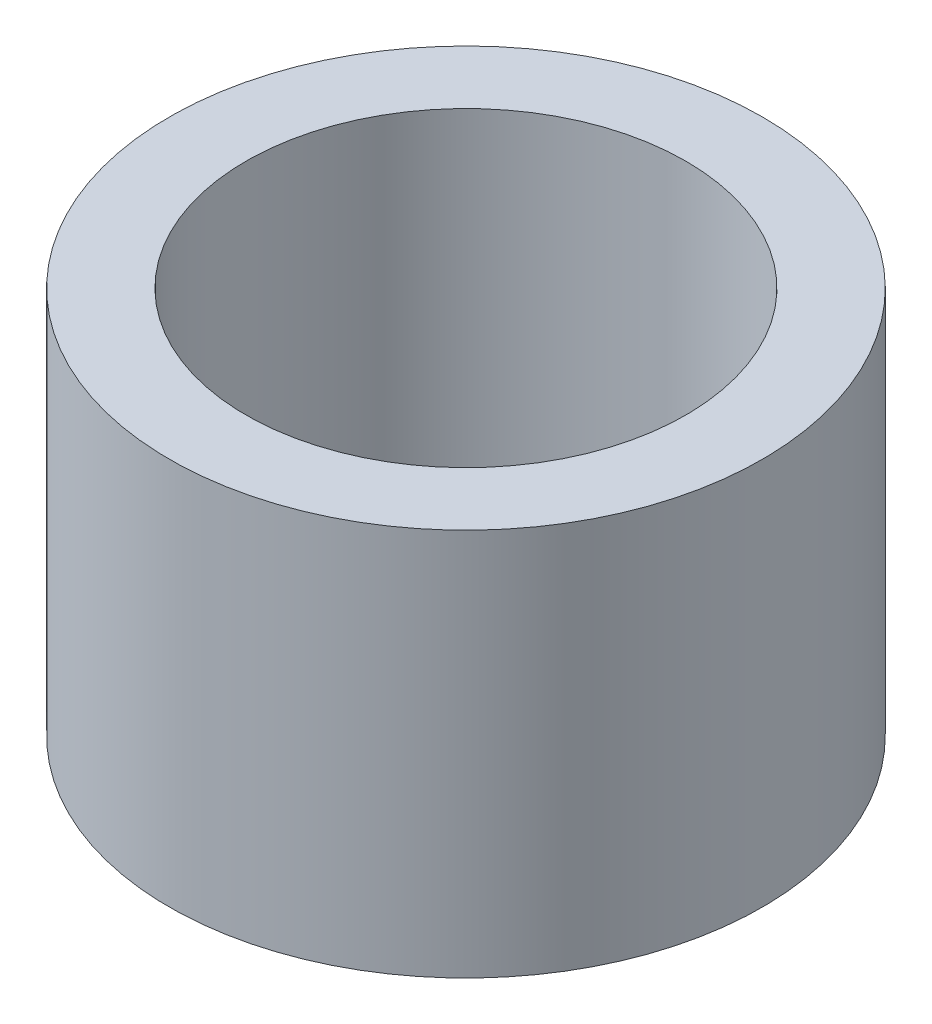
ISO-10303-21;
HEADER;
FILE_DESCRIPTION(('STEP AP214'),'2;1');
FILE_NAME('part.step','',(''),(''),'','','');
FILE_SCHEMA(('AUTOMOTIVE_DESIGN { 1 0 10303 214 1 1 1 1 }'));
ENDSEC;
DATA;
#1=APPLICATION_CONTEXT('core data for automotive mechanical design processes');
#2=APPLICATION_PROTOCOL_DEFINITION('international standard','automotive_design',2000,#1);
#3=PRODUCT_CONTEXT('',#1,'mechanical');
#4=PRODUCT('Part','Part','',(#3));
#5=PRODUCT_RELATED_PRODUCT_CATEGORY('part','',(#4));
#6=PRODUCT_DEFINITION_FORMATION('','',#4);
#7=PRODUCT_DEFINITION_CONTEXT('part definition',#1,'design');
#8=PRODUCT_DEFINITION('design','',#6,#7);
#9=PRODUCT_DEFINITION_SHAPE('','',#8);
#10=(LENGTH_UNIT() NAMED_UNIT(*) SI_UNIT(.MILLI.,.METRE.));
#11=(NAMED_UNIT(*) PLANE_ANGLE_UNIT() SI_UNIT($,.RADIAN.));
#12=(NAMED_UNIT(*) SI_UNIT($,.STERADIAN.) SOLID_ANGLE_UNIT());
#13=UNCERTAINTY_MEASURE_WITH_UNIT(LENGTH_MEASURE(1.E-05),#10,'distance_accuracy_value','');
#14=(GEOMETRIC_REPRESENTATION_CONTEXT(3) GLOBAL_UNCERTAINTY_ASSIGNED_CONTEXT((#13)) GLOBAL_UNIT_ASSIGNED_CONTEXT((#10,
#11,#12)) REPRESENTATION_CONTEXT('',''));
#15=CARTESIAN_POINT('',(0.,0.,0.));
#16=DIRECTION('',(0.,0.,1.));
#17=DIRECTION('',(1.,0.,0.));
#18=AXIS2_PLACEMENT_3D('',#15,#16,#17);
#19=CARTESIAN_POINT('',(0.,13.0809065304929,0.));
#20=DIRECTION('',(0.,-1.,0.));
#21=DIRECTION('',(0.,0.,-1.));
#22=AXIS2_PLACEMENT_3D('',#19,#20,#21);
#23=CYLINDRICAL_SURFACE('',#22,10.);
#24=CARTESIAN_POINT('',(0.,13.0809065304929,0.));
#25=DIRECTION('',(0.,1.,0.));
#26=DIRECTION('',(0.,0.,1.));
#27=AXIS2_PLACEMENT_3D('',#24,#25,#26);
#28=CIRCLE('',#27,10.);
#29=CARTESIAN_POINT('',(0.,13.0809065304929,-10.));
#30=VERTEX_POINT('',#29);
#31=EDGE_CURVE('E10',#30,#30,#28,.T.);
#32=CARTESIAN_POINT('',(0.,0.,0.));
#33=DIRECTION('',(0.,1.,0.));
#34=DIRECTION('',(0.,0.,1.));
#35=AXIS2_PLACEMENT_3D('',#32,#33,#34);
#36=CIRCLE('',#35,10.);
#37=CARTESIAN_POINT('',(0.,0.,-10.));
#38=VERTEX_POINT('',#37);
#39=EDGE_CURVE('E37',#38,#38,#36,.T.);
#40=CARTESIAN_POINT('',(0.,13.0809065304929,-10.));
#41=CARTESIAN_POINT('',(0.,12.944647087467,-10.));
#42=CARTESIAN_POINT('',(0.,12.808387644441,-10.));
#43=CARTESIAN_POINT('',(0.,12.5358687583891,-10.));
#44=CARTESIAN_POINT('',(0.,12.3996093153631,-10.));
#45=CARTESIAN_POINT('',(0.,12.1270904293112,-10.));
#46=CARTESIAN_POINT('',(0.,11.9908309862852,-10.));
#47=CARTESIAN_POINT('',(0.,11.7183121002333,-10.));
#48=CARTESIAN_POINT('',(0.,11.5820526572073,-10.));
#49=CARTESIAN_POINT('',(0.,11.3095337711554,-10.));
#50=CARTESIAN_POINT('',(0.,11.1732743281294,-10.));
#51=CARTESIAN_POINT('',(0.,10.9007554420775,-10.));
#52=CARTESIAN_POINT('',(0.,10.7644959990515,-10.));
#53=CARTESIAN_POINT('',(0.,10.4919771129996,-10.));
#54=CARTESIAN_POINT('',(0.,10.3557176699736,-10.));
#55=CARTESIAN_POINT('',(0.,10.0831987839216,-10.));
#56=CARTESIAN_POINT('',(0.,9.94693934089568,-10.));
#57=CARTESIAN_POINT('',(0.,9.67442045484374,-10.));
#58=CARTESIAN_POINT('',(0.,9.53816101181777,-10.));
#59=CARTESIAN_POINT('',(0.,9.26564212576584,-10.));
#60=CARTESIAN_POINT('',(0.,9.12938268273987,-10.));
#61=CARTESIAN_POINT('',(0.,8.85686379668793,-10.));
#62=CARTESIAN_POINT('',(0.,8.72060435366196,-10.));
#63=CARTESIAN_POINT('',(0.,8.44808546761003,-10.));
#64=CARTESIAN_POINT('',(0.,8.31182602458406,-10.));
#65=CARTESIAN_POINT('',(0.,8.03930713853212,-10.));
#66=CARTESIAN_POINT('',(0.,7.90304769550616,-10.));
#67=CARTESIAN_POINT('',(0.,7.63052880945422,-10.));
#68=CARTESIAN_POINT('',(0.,7.49426936642825,-10.));
#69=CARTESIAN_POINT('',(0.,7.22175048037631,-10.));
#70=CARTESIAN_POINT('',(0.,7.08549103735035,-10.));
#71=CARTESIAN_POINT('',(0.,6.81297215129841,-10.));
#72=CARTESIAN_POINT('',(0.,6.67671270827244,-10.));
#73=CARTESIAN_POINT('',(0.,6.40419382222051,-10.));
#74=CARTESIAN_POINT('',(0.,6.26793437919454,-10.));
#75=CARTESIAN_POINT('',(0.,5.9954154931426,-10.));
#76=CARTESIAN_POINT('',(0.,5.85915605011663,-10.));
#77=CARTESIAN_POINT('',(0.,5.5866371640647,-10.));
#78=CARTESIAN_POINT('',(0.,5.45037772103873,-10.));
#79=CARTESIAN_POINT('',(0.,5.17785883498679,-10.));
#80=CARTESIAN_POINT('',(0.,5.04159939196082,-10.));
#81=CARTESIAN_POINT('',(0.,4.76908050590889,-10.));
#82=CARTESIAN_POINT('',(0.,4.63282106288292,-10.));
#83=CARTESIAN_POINT('',(0.,4.36030217683098,-10.));
#84=CARTESIAN_POINT('',(0.,4.22404273380501,-10.));
#85=CARTESIAN_POINT('',(0.,3.95152384775308,-10.));
#86=CARTESIAN_POINT('',(0.,3.81526440472711,-10.));
#87=CARTESIAN_POINT('',(0.,3.54274551867517,-10.));
#88=CARTESIAN_POINT('',(0.,3.4064860756492,-10.));
#89=CARTESIAN_POINT('',(0.,3.13396718959727,-10.));
#90=CARTESIAN_POINT('',(0.,2.9977077465713,-10.));
#91=CARTESIAN_POINT('',(0.,2.72518886051936,-10.));
#92=CARTESIAN_POINT('',(0.,2.58892941749339,-10.));
#93=CARTESIAN_POINT('',(0.,2.31641053144146,-10.));
#94=CARTESIAN_POINT('',(0.,2.18015108841549,-10.));
#95=CARTESIAN_POINT('',(0.,1.90763220236355,-10.));
#96=CARTESIAN_POINT('',(0.,1.77137275933758,-10.));
#97=CARTESIAN_POINT('',(0.,1.49885387328565,-10.));
#98=CARTESIAN_POINT('',(0.,1.36259443025968,-10.));
#99=CARTESIAN_POINT('',(0.,1.09007554420774,-10.));
#100=CARTESIAN_POINT('',(0.,0.953816101181776,-10.));
#101=CARTESIAN_POINT('',(0.,0.68129721512984,-10.));
#102=CARTESIAN_POINT('',(0.,0.545037772103871,-10.));
#103=CARTESIAN_POINT('',(0.,0.272518886051934,-10.));
#104=CARTESIAN_POINT('',(0.,0.136259443025966,-10.));
#105=CARTESIAN_POINT('',(0.,0.,-10.));
#106=B_SPLINE_CURVE_WITH_KNOTS('',3,(#40,#41,#42,#43,#44,#45,#46,#47,#48,#49,#50,#51,#52,#53,
#54,#55,#56,#57,#58,#59,#60,#61,#62,#63,#64,#65,#66,#67,#68,#69,#70,#71,#72,#73,#74,#75,#76,#77,
#78,#79,#80,#81,#82,#83,#84,#85,#86,#87,#88,#89,#90,#91,#92,#93,#94,#95,#96,#97,#98,#99,#100,
#101,#102,#103,#104,#105),.UNSPECIFIED.,.F.,.F.,(4,2,2,2,2,2,2,2,2,2,2,2,2,2,2,2,2,2,2,2,2,2,2,
2,2,2,2,2,2,2,2,2,4),(0.,0.408778329077904,0.817556658155808,1.22633498723371,1.63511331631162,
2.04389164538952,2.45266997446743,2.86144830354533,3.27022663262324,3.67900496170114,
4.08778329077905,4.49656161985695,4.90533994893485,5.31411827801276,5.72289660709066,
6.13167493616857,6.54045326524647,6.94923159432438,7.35800992340228,7.76678825248019,
8.17556658155809,8.584344910636,8.9931232397139,9.40190156879181,9.81067989786971,
10.2194582269476,10.6282365560255,11.0370148851034,11.4457932141813,11.8545715432592,
12.2633498723371,12.672128201415,13.0809065304929),.UNSPECIFIED.);
#107=EDGE_CURVE('BSEAM40',#30,#38,#106,.T.);
#108=ORIENTED_EDGE('',*,*,#31,.F.);
#109=ORIENTED_EDGE('',*,*,#39,.T.);
#110=ORIENTED_EDGE('',*,*,#107,.T.);
#111=ORIENTED_EDGE('',*,*,#107,.F.);
#112=EDGE_LOOP('',(#108,#110,#109,#111));
#113=FACE_BOUND('',#112,.T.);
#114=ADVANCED_FACE('F40',(#113),#23,.T.);
#115=CARTESIAN_POINT('',(0.,13.0809065304929,0.));
#116=DIRECTION('',(0.,1.,0.));
#117=DIRECTION('',(0.,0.,1.));
#118=AXIS2_PLACEMENT_3D('',#115,#116,#117);
#119=PLANE('',#118);
#120=CARTESIAN_POINT('',(0.,13.0809065304929,0.));
#121=DIRECTION('',(0.,1.,0.));
#122=DIRECTION('',(0.,0.,1.));
#123=AXIS2_PLACEMENT_3D('',#120,#121,#122);
#124=CIRCLE('',#123,7.41722982406805);
#125=CARTESIAN_POINT('',(0.,13.0809065304929,-7.41722982406805));
#126=VERTEX_POINT('',#125);
#127=EDGE_CURVE('E50',#126,#126,#124,.T.);
#128=ORIENTED_EDGE('',*,*,#127,.F.);
#129=EDGE_LOOP('',(#128));
#130=FACE_BOUND('',#129,.T.);
#131=ORIENTED_EDGE('',*,*,#31,.T.);
#132=EDGE_LOOP('',(#131));
#133=FACE_BOUND('',#132,.T.);
#134=ADVANCED_FACE('F59',(#130,#133),#119,.T.);
#135=CARTESIAN_POINT('',(0.,0.,0.));
#136=DIRECTION('',(0.,1.,0.));
#137=DIRECTION('',(0.,0.,1.));
#138=AXIS2_PLACEMENT_3D('',#135,#136,#137);
#139=PLANE('',#138);
#140=CARTESIAN_POINT('',(0.,0.,0.));
#141=DIRECTION('',(0.,1.,0.));
#142=DIRECTION('',(0.,0.,1.));
#143=AXIS2_PLACEMENT_3D('',#140,#141,#142);
#144=CIRCLE('',#143,7.41722982406805);
#145=CARTESIAN_POINT('',(0.,0.,-7.41722982406805));
#146=VERTEX_POINT('',#145);
#147=EDGE_CURVE('E47',#146,#146,#144,.T.);
#148=ORIENTED_EDGE('',*,*,#147,.T.);
#149=EDGE_LOOP('',(#148));
#150=FACE_BOUND('',#149,.T.);
#151=ORIENTED_EDGE('',*,*,#39,.F.);
#152=EDGE_LOOP('',(#151));
#153=FACE_BOUND('',#152,.T.);
#154=ADVANCED_FACE('F58',(#150,#153),#139,.F.);
#155=CARTESIAN_POINT('',(0.,13.0809065304929,0.));
#156=DIRECTION('',(0.,-1.,0.));
#157=DIRECTION('',(0.,0.,-1.));
#158=AXIS2_PLACEMENT_3D('',#155,#156,#157);
#159=CYLINDRICAL_SURFACE('',#158,7.41722982406805);
#160=CARTESIAN_POINT('',(0.,13.0809065304929,-7.41722982406805));
#161=CARTESIAN_POINT('',(0.,12.944647087467,-7.41722982406805));
#162=CARTESIAN_POINT('',(0.,12.808387644441,-7.41722982406805));
#163=CARTESIAN_POINT('',(0.,12.5358687583891,-7.41722982406805));
#164=CARTESIAN_POINT('',(0.,12.3996093153631,-7.41722982406805));
#165=CARTESIAN_POINT('',(0.,12.1270904293112,-7.41722982406805));
#166=CARTESIAN_POINT('',(0.,11.9908309862852,-7.41722982406805));
#167=CARTESIAN_POINT('',(0.,11.7183121002333,-7.41722982406805));
#168=CARTESIAN_POINT('',(0.,11.5820526572073,-7.41722982406805));
#169=CARTESIAN_POINT('',(0.,11.3095337711554,-7.41722982406805));
#170=CARTESIAN_POINT('',(0.,11.1732743281294,-7.41722982406805));
#171=CARTESIAN_POINT('',(0.,10.9007554420775,-7.41722982406805));
#172=CARTESIAN_POINT('',(0.,10.7644959990515,-7.41722982406805));
#173=CARTESIAN_POINT('',(0.,10.4919771129996,-7.41722982406805));
#174=CARTESIAN_POINT('',(0.,10.3557176699736,-7.41722982406805));
#175=CARTESIAN_POINT('',(0.,10.0831987839216,-7.41722982406805));
#176=CARTESIAN_POINT('',(0.,9.94693934089568,-7.41722982406805));
#177=CARTESIAN_POINT('',(0.,9.67442045484374,-7.41722982406805));
#178=CARTESIAN_POINT('',(0.,9.53816101181777,-7.41722982406805));
#179=CARTESIAN_POINT('',(0.,9.26564212576584,-7.41722982406805));
#180=CARTESIAN_POINT('',(0.,9.12938268273987,-7.41722982406805));
#181=CARTESIAN_POINT('',(0.,8.85686379668793,-7.41722982406805));
#182=CARTESIAN_POINT('',(0.,8.72060435366196,-7.41722982406805));
#183=CARTESIAN_POINT('',(0.,8.44808546761003,-7.41722982406805));
#184=CARTESIAN_POINT('',(0.,8.31182602458406,-7.41722982406805));
#185=CARTESIAN_POINT('',(0.,8.03930713853212,-7.41722982406805));
#186=CARTESIAN_POINT('',(0.,7.90304769550616,-7.41722982406805));
#187=CARTESIAN_POINT('',(0.,7.63052880945422,-7.41722982406805));
#188=CARTESIAN_POINT('',(0.,7.49426936642825,-7.41722982406805));
#189=CARTESIAN_POINT('',(0.,7.22175048037631,-7.41722982406805));
#190=CARTESIAN_POINT('',(0.,7.08549103735035,-7.41722982406805));
#191=CARTESIAN_POINT('',(0.,6.81297215129841,-7.41722982406805));
#192=CARTESIAN_POINT('',(0.,6.67671270827244,-7.41722982406805));
#193=CARTESIAN_POINT('',(0.,6.40419382222051,-7.41722982406805));
#194=CARTESIAN_POINT('',(0.,6.26793437919454,-7.41722982406805));
#195=CARTESIAN_POINT('',(0.,5.9954154931426,-7.41722982406805));
#196=CARTESIAN_POINT('',(0.,5.85915605011663,-7.41722982406805));
#197=CARTESIAN_POINT('',(0.,5.5866371640647,-7.41722982406805));
#198=CARTESIAN_POINT('',(0.,5.45037772103873,-7.41722982406805));
#199=CARTESIAN_POINT('',(0.,5.17785883498679,-7.41722982406805));
#200=CARTESIAN_POINT('',(0.,5.04159939196082,-7.41722982406805));
#201=CARTESIAN_POINT('',(0.,4.76908050590889,-7.41722982406805));
#202=CARTESIAN_POINT('',(0.,4.63282106288292,-7.41722982406805));
#203=CARTESIAN_POINT('',(0.,4.36030217683098,-7.41722982406805));
#204=CARTESIAN_POINT('',(0.,4.22404273380501,-7.41722982406805));
#205=CARTESIAN_POINT('',(0.,3.95152384775308,-7.41722982406805));
#206=CARTESIAN_POINT('',(0.,3.81526440472711,-7.41722982406805));
#207=CARTESIAN_POINT('',(0.,3.54274551867517,-7.41722982406805));
#208=CARTESIAN_POINT('',(0.,3.4064860756492,-7.41722982406805));
#209=CARTESIAN_POINT('',(0.,3.13396718959727,-7.41722982406805));
#210=CARTESIAN_POINT('',(0.,2.9977077465713,-7.41722982406805));
#211=CARTESIAN_POINT('',(0.,2.72518886051936,-7.41722982406805));
#212=CARTESIAN_POINT('',(0.,2.58892941749339,-7.41722982406805));
#213=CARTESIAN_POINT('',(0.,2.31641053144146,-7.41722982406805));
#214=CARTESIAN_POINT('',(0.,2.18015108841549,-7.41722982406805));
#215=CARTESIAN_POINT('',(0.,1.90763220236355,-7.41722982406805));
#216=CARTESIAN_POINT('',(0.,1.77137275933758,-7.41722982406805));
#217=CARTESIAN_POINT('',(0.,1.49885387328565,-7.41722982406805));
#218=CARTESIAN_POINT('',(0.,1.36259443025968,-7.41722982406805));
#219=CARTESIAN_POINT('',(0.,1.09007554420774,-7.41722982406805));
#220=CARTESIAN_POINT('',(0.,0.953816101181776,-7.41722982406805));
#221=CARTESIAN_POINT('',(0.,0.68129721512984,-7.41722982406805));
#222=CARTESIAN_POINT('',(0.,0.545037772103871,-7.41722982406805));
#223=CARTESIAN_POINT('',(0.,0.272518886051934,-7.41722982406805));
#224=CARTESIAN_POINT('',(0.,0.136259443025966,-7.41722982406805));
#225=CARTESIAN_POINT('',(0.,0.,-7.41722982406805));
#226=B_SPLINE_CURVE_WITH_KNOTS('',3,(#160,#161,#162,#163,#164,#165,#166,#167,#168,#169,#170,
#171,#172,#173,#174,#175,#176,#177,#178,#179,#180,#181,#182,#183,#184,#185,#186,#187,#188,#189,
#190,#191,#192,#193,#194,#195,#196,#197,#198,#199,#200,#201,#202,#203,#204,#205,#206,#207,#208,
#209,#210,#211,#212,#213,#214,#215,#216,#217,#218,#219,#220,#221,#222,#223,#224,#225),
.UNSPECIFIED.,.F.,.F.,(4,2,2,2,2,2,2,2,2,2,2,2,2,2,2,2,2,2,2,2,2,2,2,2,2,2,2,2,2,2,2,2,4),(0.,
0.408778329077904,0.817556658155808,1.22633498723371,1.63511331631162,2.04389164538952,
2.45266997446743,2.86144830354533,3.27022663262324,3.67900496170114,4.08778329077905,
4.49656161985695,4.90533994893485,5.31411827801276,5.72289660709066,6.13167493616857,
6.54045326524647,6.94923159432438,7.35800992340228,7.76678825248019,8.17556658155809,
8.584344910636,8.9931232397139,9.40190156879181,9.81067989786971,10.2194582269476,
10.6282365560255,11.0370148851034,11.4457932141813,11.8545715432592,12.2633498723371,
12.672128201415,13.0809065304929),.UNSPECIFIED.);
#227=EDGE_CURVE('BSEAM54',#126,#146,#226,.T.);
#228=ORIENTED_EDGE('',*,*,#127,.T.);
#229=ORIENTED_EDGE('',*,*,#147,.F.);
#230=ORIENTED_EDGE('',*,*,#227,.T.);
#231=ORIENTED_EDGE('',*,*,#227,.F.);
#232=EDGE_LOOP('',(#228,#230,#229,#231));
#233=FACE_BOUND('',#232,.T.);
#234=ADVANCED_FACE('F54',(#233),#159,.F.);
#235=CLOSED_SHELL('',(#114,#134,#154,#234));
#236=MANIFOLD_SOLID_BREP('B2',#235);
#237=ADVANCED_BREP_SHAPE_REPRESENTATION('',(#18,#236),#14);
#238=SHAPE_DEFINITION_REPRESENTATION(#9,#237);
ENDSEC;
END-ISO-10303-21;
